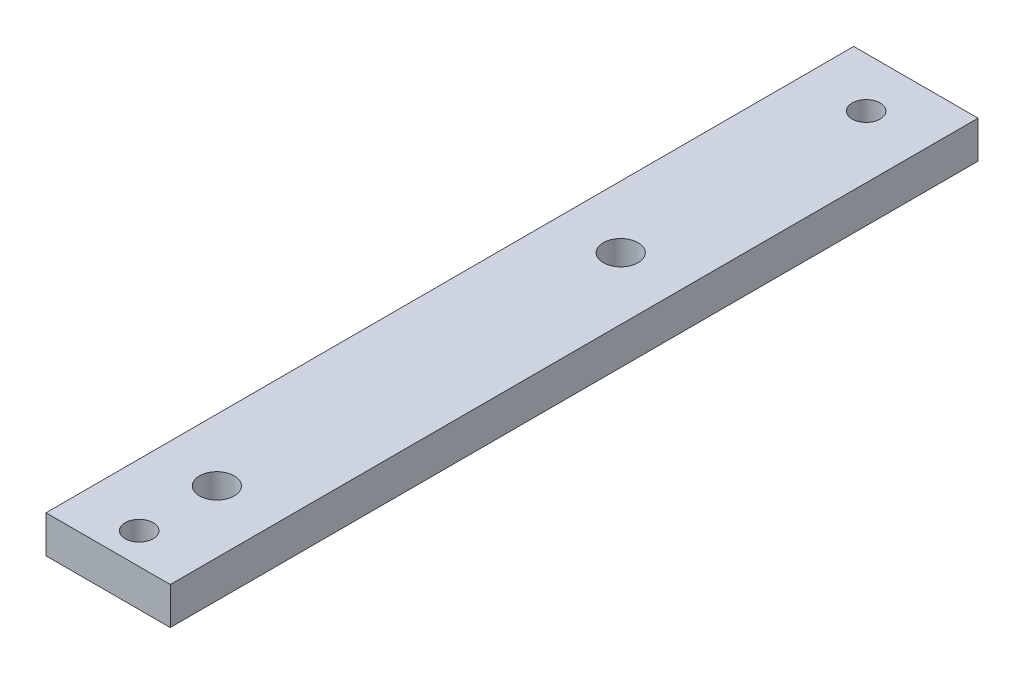
ISO-10303-21;
HEADER;
FILE_DESCRIPTION(('STEP AP214'),'2;1');
FILE_NAME('part.step','',(''),(''),'','','');
FILE_SCHEMA(('AUTOMOTIVE_DESIGN { 1 0 10303 214 1 1 1 1 }'));
ENDSEC;
DATA;
#1=APPLICATION_CONTEXT('core data for automotive mechanical design processes');
#2=APPLICATION_PROTOCOL_DEFINITION('international standard','automotive_design',2000,#1);
#3=PRODUCT_CONTEXT('',#1,'mechanical');
#4=PRODUCT('Part','Part','',(#3));
#5=PRODUCT_RELATED_PRODUCT_CATEGORY('part','',(#4));
#6=PRODUCT_DEFINITION_FORMATION('','',#4);
#7=PRODUCT_DEFINITION_CONTEXT('part definition',#1,'design');
#8=PRODUCT_DEFINITION('design','',#6,#7);
#9=PRODUCT_DEFINITION_SHAPE('','',#8);
#10=(LENGTH_UNIT() NAMED_UNIT(*) SI_UNIT(.MILLI.,.METRE.));
#11=(NAMED_UNIT(*) PLANE_ANGLE_UNIT() SI_UNIT($,.RADIAN.));
#12=(NAMED_UNIT(*) SI_UNIT($,.STERADIAN.) SOLID_ANGLE_UNIT());
#13=UNCERTAINTY_MEASURE_WITH_UNIT(LENGTH_MEASURE(1.E-05),#10,'distance_accuracy_value','');
#14=(GEOMETRIC_REPRESENTATION_CONTEXT(3) GLOBAL_UNCERTAINTY_ASSIGNED_CONTEXT((#13)) GLOBAL_UNIT_ASSIGNED_CONTEXT((#10,
#11,#12)) REPRESENTATION_CONTEXT('',''));
#15=CARTESIAN_POINT('',(0.,0.,0.));
#16=DIRECTION('',(0.,0.,1.));
#17=DIRECTION('',(1.,0.,0.));
#18=AXIS2_PLACEMENT_3D('',#15,#16,#17);
#19=CARTESIAN_POINT('',(0.,3.,0.));
#20=DIRECTION('',(0.,1.,0.));
#21=DIRECTION('',(0.,0.,1.));
#22=AXIS2_PLACEMENT_3D('',#19,#20,#21);
#23=PLANE('',#22);
#24=CARTESIAN_POINT('',(-1.08695652173912,3.,-10.4565217391304));
#25=DIRECTION('',(0.,1.,0.));
#26=DIRECTION('',(0.,0.,1.));
#27=AXIS2_PLACEMENT_3D('',#24,#25,#26);
#28=CIRCLE('',#27,1.125);
#29=CARTESIAN_POINT('',(-1.08695652173912,3.,-9.33152173913043));
#30=VERTEX_POINT('',#29);
#31=EDGE_CURVE('E121',#30,#30,#28,.T.);
#32=ORIENTED_EDGE('',*,*,#31,.F.);
#33=EDGE_LOOP('',(#32));
#34=FACE_BOUND('',#33,.T.);
#35=CARTESIAN_POINT('',(-1.08695652173912,3.,9.29347826086958));
#36=DIRECTION('',(0.,1.,0.));
#37=DIRECTION('',(0.,0.,1.));
#38=AXIS2_PLACEMENT_3D('',#35,#36,#37);
#39=CIRCLE('',#38,1.4);
#40=CARTESIAN_POINT('',(-1.08695652173912,3.,10.6934782608696));
#41=VERTEX_POINT('',#40);
#42=EDGE_CURVE('E100',#41,#41,#39,.T.);
#43=ORIENTED_EDGE('',*,*,#42,.F.);
#44=EDGE_LOOP('',(#43));
#45=FACE_BOUND('',#44,.T.);
#46=DIRECTION('',(0.,0.,1.));
#47=VECTOR('',#46,1.);
#48=CARTESIAN_POINT('',(-6.08695652173913,3.,-14.4565217391304));
#49=LINE('',#48,#47);
#50=CARTESIAN_POINT('',(-6.08695652173913,3.,-14.4565217391304));
#51=VERTEX_POINT('',#50);
#52=CARTESIAN_POINT('',(-6.08695652173912,3.,50.5434782608696));
#53=VERTEX_POINT('',#52);
#54=EDGE_CURVE('E85',#51,#53,#49,.T.);
#55=ORIENTED_EDGE('',*,*,#54,.T.);
#56=DIRECTION('',(1.,0.,0.));
#57=VECTOR('',#56,1.);
#58=CARTESIAN_POINT('',(-6.08695652173912,3.,50.5434782608696));
#59=LINE('',#58,#57);
#60=CARTESIAN_POINT('',(3.91304347826088,3.,50.5434782608696));
#61=VERTEX_POINT('',#60);
#62=EDGE_CURVE('E80',#53,#61,#59,.T.);
#63=ORIENTED_EDGE('',*,*,#62,.T.);
#64=DIRECTION('',(0.,0.,-1.));
#65=VECTOR('',#64,1.);
#66=CARTESIAN_POINT('',(3.91304347826087,3.,-14.4565217391304));
#67=LINE('',#66,#65);
#68=CARTESIAN_POINT('',(3.91304347826087,3.,-14.4565217391304));
#69=VERTEX_POINT('',#68);
#70=EDGE_CURVE('E83',#61,#69,#67,.T.);
#71=ORIENTED_EDGE('',*,*,#70,.T.);
#72=DIRECTION('',(-1.,0.,0.));
#73=VECTOR('',#72,1.);
#74=CARTESIAN_POINT('',(-6.08695652173913,3.,-14.4565217391304));
#75=LINE('',#74,#73);
#76=EDGE_CURVE('E50',#69,#51,#75,.T.);
#77=ORIENTED_EDGE('',*,*,#76,.T.);
#78=EDGE_LOOP('',(#55,#63,#71,#77));
#79=FACE_BOUND('',#78,.T.);
#80=CARTESIAN_POINT('',(-1.08695652173912,3.,41.7934782608696));
#81=DIRECTION('',(0.,1.,0.));
#82=DIRECTION('',(0.,0.,1.));
#83=AXIS2_PLACEMENT_3D('',#80,#81,#82);
#84=CIRCLE('',#83,1.4);
#85=CARTESIAN_POINT('',(-1.08695652173912,3.,43.1934782608696));
#86=VERTEX_POINT('',#85);
#87=EDGE_CURVE('E115',#86,#86,#84,.T.);
#88=ORIENTED_EDGE('',*,*,#87,.F.);
#89=EDGE_LOOP('',(#88));
#90=FACE_BOUND('',#89,.T.);
#91=CARTESIAN_POINT('',(-1.08695652173912,3.,48.0434782608696));
#92=DIRECTION('',(0.,1.,0.));
#93=DIRECTION('',(0.,0.,1.));
#94=AXIS2_PLACEMENT_3D('',#91,#92,#93);
#95=CIRCLE('',#94,1.125);
#96=CARTESIAN_POINT('',(-1.08695652173912,3.,49.1684782608696));
#97=VERTEX_POINT('',#96);
#98=EDGE_CURVE('E127',#97,#97,#95,.T.);
#99=ORIENTED_EDGE('',*,*,#98,.F.);
#100=EDGE_LOOP('',(#99));
#101=FACE_BOUND('',#100,.T.);
#102=ADVANCED_FACE('F33',(#34,#45,#79,#90,#101),#23,.T.);
#103=CARTESIAN_POINT('',(0.,0.,0.));
#104=DIRECTION('',(0.,1.,0.));
#105=DIRECTION('',(0.,0.,1.));
#106=AXIS2_PLACEMENT_3D('',#103,#104,#105);
#107=PLANE('',#106);
#108=DIRECTION('',(0.,0.,1.));
#109=VECTOR('',#108,1.);
#110=CARTESIAN_POINT('',(-6.08695652173913,0.,-14.4565217391304));
#111=LINE('',#110,#109);
#112=CARTESIAN_POINT('',(-6.08695652173913,0.,-14.4565217391304));
#113=VERTEX_POINT('',#112);
#114=CARTESIAN_POINT('',(-6.08695652173912,0.,50.5434782608696));
#115=VERTEX_POINT('',#114);
#116=EDGE_CURVE('E97',#113,#115,#111,.T.);
#117=ORIENTED_EDGE('',*,*,#116,.F.);
#118=DIRECTION('',(-1.,0.,0.));
#119=VECTOR('',#118,1.);
#120=CARTESIAN_POINT('',(-6.08695652173913,0.,-14.4565217391304));
#121=LINE('',#120,#119);
#122=CARTESIAN_POINT('',(3.91304347826087,0.,-14.4565217391304));
#123=VERTEX_POINT('',#122);
#124=EDGE_CURVE('E73',#123,#113,#121,.T.);
#125=ORIENTED_EDGE('',*,*,#124,.F.);
#126=DIRECTION('',(0.,0.,-1.));
#127=VECTOR('',#126,1.);
#128=CARTESIAN_POINT('',(3.91304347826087,0.,-14.4565217391304));
#129=LINE('',#128,#127);
#130=CARTESIAN_POINT('',(3.91304347826088,0.,50.5434782608696));
#131=VERTEX_POINT('',#130);
#132=EDGE_CURVE('E67',#131,#123,#129,.T.);
#133=ORIENTED_EDGE('',*,*,#132,.F.);
#134=DIRECTION('',(1.,0.,0.));
#135=VECTOR('',#134,1.);
#136=CARTESIAN_POINT('',(-6.08695652173912,0.,50.5434782608696));
#137=LINE('',#136,#135);
#138=EDGE_CURVE('E89',#115,#131,#137,.T.);
#139=ORIENTED_EDGE('',*,*,#138,.F.);
#140=EDGE_LOOP('',(#117,#125,#133,#139));
#141=FACE_BOUND('',#140,.T.);
#142=CARTESIAN_POINT('',(-1.08695652173912,0.,9.29347826086958));
#143=DIRECTION('',(0.,1.,0.));
#144=DIRECTION('',(0.,0.,1.));
#145=AXIS2_PLACEMENT_3D('',#142,#143,#144);
#146=CIRCLE('',#145,1.4);
#147=CARTESIAN_POINT('',(-1.08695652173912,0.,10.6934782608696));
#148=VERTEX_POINT('',#147);
#149=EDGE_CURVE('E112',#148,#148,#146,.T.);
#150=ORIENTED_EDGE('',*,*,#149,.T.);
#151=EDGE_LOOP('',(#150));
#152=FACE_BOUND('',#151,.T.);
#153=CARTESIAN_POINT('',(-1.08695652173912,0.,41.7934782608696));
#154=DIRECTION('',(0.,1.,0.));
#155=DIRECTION('',(0.,0.,1.));
#156=AXIS2_PLACEMENT_3D('',#153,#154,#155);
#157=CIRCLE('',#156,1.4);
#158=CARTESIAN_POINT('',(-1.08695652173912,0.,43.1934782608696));
#159=VERTEX_POINT('',#158);
#160=EDGE_CURVE('E118',#159,#159,#157,.T.);
#161=ORIENTED_EDGE('',*,*,#160,.T.);
#162=EDGE_LOOP('',(#161));
#163=FACE_BOUND('',#162,.T.);
#164=CARTESIAN_POINT('',(-1.08695652173912,0.,-10.4565217391304));
#165=DIRECTION('',(0.,1.,0.));
#166=DIRECTION('',(0.,0.,1.));
#167=AXIS2_PLACEMENT_3D('',#164,#165,#166);
#168=CIRCLE('',#167,1.125);
#169=CARTESIAN_POINT('',(-1.08695652173912,0.,-9.33152173913043));
#170=VERTEX_POINT('',#169);
#171=EDGE_CURVE('E124',#170,#170,#168,.T.);
#172=ORIENTED_EDGE('',*,*,#171,.T.);
#173=EDGE_LOOP('',(#172));
#174=FACE_BOUND('',#173,.T.);
#175=CARTESIAN_POINT('',(-1.08695652173912,0.,48.0434782608696));
#176=DIRECTION('',(0.,1.,0.));
#177=DIRECTION('',(0.,0.,1.));
#178=AXIS2_PLACEMENT_3D('',#175,#176,#177);
#179=CIRCLE('',#178,1.125);
#180=CARTESIAN_POINT('',(-1.08695652173912,0.,49.1684782608696));
#181=VERTEX_POINT('',#180);
#182=EDGE_CURVE('E130',#181,#181,#179,.T.);
#183=ORIENTED_EDGE('',*,*,#182,.T.);
#184=EDGE_LOOP('',(#183));
#185=FACE_BOUND('',#184,.T.);
#186=ADVANCED_FACE('F108',(#141,#152,#163,#174,#185),#107,.F.);
#187=CARTESIAN_POINT('',(-6.08695652173913,3.,-14.4565217391304));
#188=DIRECTION('',(1.,0.,0.));
#189=DIRECTION('',(0.,0.,-1.));
#190=AXIS2_PLACEMENT_3D('',#187,#188,#189);
#191=PLANE('',#190);
#192=ORIENTED_EDGE('',*,*,#116,.T.);
#193=DIRECTION('',(0.,-1.,0.));
#194=VECTOR('',#193,1.);
#195=CARTESIAN_POINT('',(-6.08695652173912,3.,50.5434782608696));
#196=LINE('',#195,#194);
#197=EDGE_CURVE('E11',#53,#115,#196,.T.);
#198=ORIENTED_EDGE('',*,*,#197,.F.);
#199=ORIENTED_EDGE('',*,*,#54,.F.);
#200=DIRECTION('',(0.,-1.,0.));
#201=VECTOR('',#200,1.);
#202=CARTESIAN_POINT('',(-6.08695652173913,3.,-14.4565217391304));
#203=LINE('',#202,#201);
#204=EDGE_CURVE('E93',#51,#113,#203,.T.);
#205=ORIENTED_EDGE('',*,*,#204,.T.);
#206=EDGE_LOOP('',(#192,#198,#199,#205));
#207=FACE_BOUND('',#206,.T.);
#208=ADVANCED_FACE('F35',(#207),#191,.F.);
#209=CARTESIAN_POINT('',(-6.08695652173912,3.,50.5434782608696));
#210=DIRECTION('',(0.,0.,-1.));
#211=DIRECTION('',(-1.,0.,0.));
#212=AXIS2_PLACEMENT_3D('',#209,#210,#211);
#213=PLANE('',#212);
#214=ORIENTED_EDGE('',*,*,#138,.T.);
#215=DIRECTION('',(0.,-1.,0.));
#216=VECTOR('',#215,1.);
#217=CARTESIAN_POINT('',(3.91304347826088,3.,50.5434782608696));
#218=LINE('',#217,#216);
#219=EDGE_CURVE('E42',#61,#131,#218,.T.);
#220=ORIENTED_EDGE('',*,*,#219,.F.);
#221=ORIENTED_EDGE('',*,*,#62,.F.);
#222=ORIENTED_EDGE('',*,*,#197,.T.);
#223=EDGE_LOOP('',(#214,#220,#221,#222));
#224=FACE_BOUND('',#223,.T.);
#225=ADVANCED_FACE('F88',(#224),#213,.F.);
#226=CARTESIAN_POINT('',(3.91304347826087,3.,-14.4565217391304));
#227=DIRECTION('',(-1.,0.,0.));
#228=DIRECTION('',(0.,0.,1.));
#229=AXIS2_PLACEMENT_3D('',#226,#227,#228);
#230=PLANE('',#229);
#231=ORIENTED_EDGE('',*,*,#132,.T.);
#232=DIRECTION('',(0.,-1.,0.));
#233=VECTOR('',#232,1.);
#234=CARTESIAN_POINT('',(3.91304347826087,3.,-14.4565217391304));
#235=LINE('',#234,#233);
#236=EDGE_CURVE('E90',#69,#123,#235,.T.);
#237=ORIENTED_EDGE('',*,*,#236,.F.);
#238=ORIENTED_EDGE('',*,*,#70,.F.);
#239=ORIENTED_EDGE('',*,*,#219,.T.);
#240=EDGE_LOOP('',(#231,#237,#238,#239));
#241=FACE_BOUND('',#240,.T.);
#242=ADVANCED_FACE('F91',(#241),#230,.F.);
#243=CARTESIAN_POINT('',(-6.08695652173913,3.,-14.4565217391304));
#244=DIRECTION('',(0.,0.,1.));
#245=DIRECTION('',(1.,0.,0.));
#246=AXIS2_PLACEMENT_3D('',#243,#244,#245);
#247=PLANE('',#246);
#248=ORIENTED_EDGE('',*,*,#124,.T.);
#249=ORIENTED_EDGE('',*,*,#204,.F.);
#250=ORIENTED_EDGE('',*,*,#76,.F.);
#251=ORIENTED_EDGE('',*,*,#236,.T.);
#252=EDGE_LOOP('',(#248,#249,#250,#251));
#253=FACE_BOUND('',#252,.T.);
#254=ADVANCED_FACE('F105',(#253),#247,.F.);
#255=CARTESIAN_POINT('',(-1.08695652173912,3.,9.29347826086958));
#256=DIRECTION('',(0.,-1.,0.));
#257=DIRECTION('',(0.,0.,-1.));
#258=AXIS2_PLACEMENT_3D('',#255,#256,#257);
#259=CYLINDRICAL_SURFACE('',#258,1.4);
#260=ORIENTED_EDGE('',*,*,#42,.T.);
#261=EDGE_LOOP('',(#260));
#262=FACE_BOUND('',#261,.T.);
#263=ORIENTED_EDGE('',*,*,#149,.F.);
#264=EDGE_LOOP('',(#263));
#265=FACE_BOUND('',#264,.T.);
#266=ADVANCED_FACE('F149',(#262,#265),#259,.F.);
#267=CARTESIAN_POINT('',(-1.08695652173912,3.,41.7934782608696));
#268=DIRECTION('',(0.,-1.,0.));
#269=DIRECTION('',(0.,0.,-1.));
#270=AXIS2_PLACEMENT_3D('',#267,#268,#269);
#271=CYLINDRICAL_SURFACE('',#270,1.4);
#272=ORIENTED_EDGE('',*,*,#87,.T.);
#273=EDGE_LOOP('',(#272));
#274=FACE_BOUND('',#273,.T.);
#275=ORIENTED_EDGE('',*,*,#160,.F.);
#276=EDGE_LOOP('',(#275));
#277=FACE_BOUND('',#276,.T.);
#278=ADVANCED_FACE('F195',(#274,#277),#271,.F.);
#279=CARTESIAN_POINT('',(-1.08695652173912,3.,-10.4565217391304));
#280=DIRECTION('',(0.,-1.,0.));
#281=DIRECTION('',(0.,0.,-1.));
#282=AXIS2_PLACEMENT_3D('',#279,#280,#281);
#283=CYLINDRICAL_SURFACE('',#282,1.125);
#284=ORIENTED_EDGE('',*,*,#31,.T.);
#285=EDGE_LOOP('',(#284));
#286=FACE_BOUND('',#285,.T.);
#287=ORIENTED_EDGE('',*,*,#171,.F.);
#288=EDGE_LOOP('',(#287));
#289=FACE_BOUND('',#288,.T.);
#290=ADVANCED_FACE('F203',(#286,#289),#283,.F.);
#291=CARTESIAN_POINT('',(-1.08695652173912,3.,48.0434782608696));
#292=DIRECTION('',(0.,-1.,0.));
#293=DIRECTION('',(0.,0.,-1.));
#294=AXIS2_PLACEMENT_3D('',#291,#292,#293);
#295=CYLINDRICAL_SURFACE('',#294,1.125);
#296=ORIENTED_EDGE('',*,*,#98,.T.);
#297=EDGE_LOOP('',(#296));
#298=FACE_BOUND('',#297,.T.);
#299=ORIENTED_EDGE('',*,*,#182,.F.);
#300=EDGE_LOOP('',(#299));
#301=FACE_BOUND('',#300,.T.);
#302=ADVANCED_FACE('F136',(#298,#301),#295,.F.);
#303=CLOSED_SHELL('',(#102,#186,#208,#225,#242,#254,#266,#278,#290,#302));
#304=MANIFOLD_SOLID_BREP('B2',#303);
#305=ADVANCED_BREP_SHAPE_REPRESENTATION('',(#18,#304),#14);
#306=SHAPE_DEFINITION_REPRESENTATION(#9,#305);
ENDSEC;
END-ISO-10303-21;
